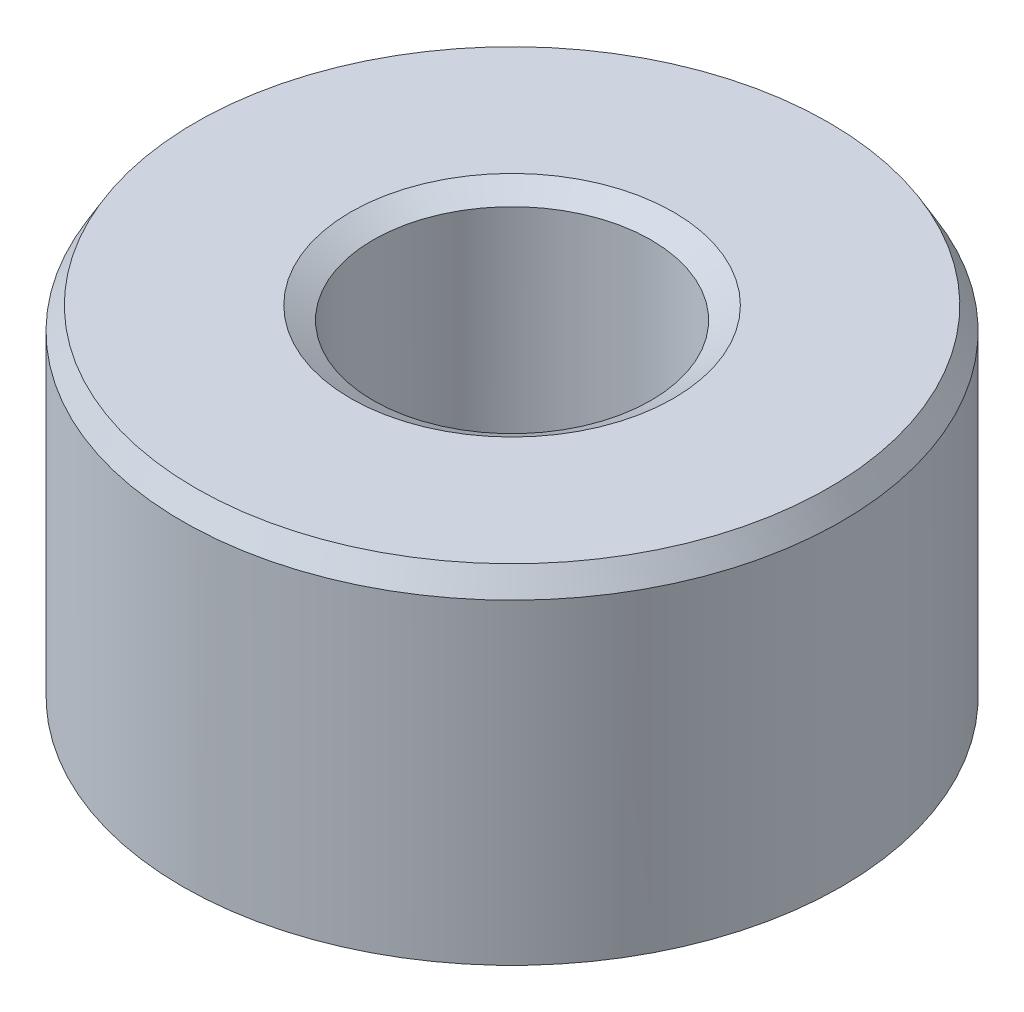
ISO-10303-21;
HEADER;
FILE_DESCRIPTION(('STEP AP214'),'2;1');
FILE_NAME('part.step','',(''),(''),'','','');
FILE_SCHEMA(('AUTOMOTIVE_DESIGN { 1 0 10303 214 1 1 1 1 }'));
ENDSEC;
DATA;
#1=APPLICATION_CONTEXT('core data for automotive mechanical design processes');
#2=APPLICATION_PROTOCOL_DEFINITION('international standard','automotive_design',2000,#1);
#3=PRODUCT_CONTEXT('',#1,'mechanical');
#4=PRODUCT('Part','Part','',(#3));
#5=PRODUCT_RELATED_PRODUCT_CATEGORY('part','',(#4));
#6=PRODUCT_DEFINITION_FORMATION('','',#4);
#7=PRODUCT_DEFINITION_CONTEXT('part definition',#1,'design');
#8=PRODUCT_DEFINITION('design','',#6,#7);
#9=PRODUCT_DEFINITION_SHAPE('','',#8);
#10=(LENGTH_UNIT() NAMED_UNIT(*) SI_UNIT(.MILLI.,.METRE.));
#11=(NAMED_UNIT(*) PLANE_ANGLE_UNIT() SI_UNIT($,.RADIAN.));
#12=(NAMED_UNIT(*) SI_UNIT($,.STERADIAN.) SOLID_ANGLE_UNIT());
#13=UNCERTAINTY_MEASURE_WITH_UNIT(LENGTH_MEASURE(1.E-05),#10,'distance_accuracy_value','');
#14=(GEOMETRIC_REPRESENTATION_CONTEXT(3) GLOBAL_UNCERTAINTY_ASSIGNED_CONTEXT((#13)) GLOBAL_UNIT_ASSIGNED_CONTEXT((#10,
#11,#12)) REPRESENTATION_CONTEXT('',''));
#15=CARTESIAN_POINT('',(0.,0.,0.));
#16=DIRECTION('',(0.,0.,1.));
#17=DIRECTION('',(1.,0.,0.));
#18=AXIS2_PLACEMENT_3D('',#15,#16,#17);
#19=CARTESIAN_POINT('',(0.,61.3514045322758,0.));
#20=DIRECTION('',(0.,-1.,0.));
#21=DIRECTION('',(0.,0.,-1.));
#22=AXIS2_PLACEMENT_3D('',#19,#20,#21);
#23=CYLINDRICAL_SURFACE('',#22,57.5);
#24=CARTESIAN_POINT('',(0.,2.25971727212847,0.));
#25=DIRECTION('',(0.,1.,0.));
#26=DIRECTION('',(0.,0.,1.));
#27=AXIS2_PLACEMENT_3D('',#24,#25,#26);
#28=CIRCLE('',#27,57.5);
#29=CARTESIAN_POINT('',(0.,2.25971727212847,-57.5));
#30=VERTEX_POINT('',#29);
#31=EDGE_CURVE('E10',#30,#30,#28,.T.);
#32=CARTESIAN_POINT('',(0.,57.4374594062086,0.));
#33=DIRECTION('',(0.,1.,0.));
#34=DIRECTION('',(0.,0.,1.));
#35=AXIS2_PLACEMENT_3D('',#32,#33,#34);
#36=CIRCLE('',#35,57.5);
#37=CARTESIAN_POINT('',(0.,57.4374594062086,-57.5));
#38=VERTEX_POINT('',#37);
#39=EDGE_CURVE('E50',#38,#38,#36,.F.);
#40=CARTESIAN_POINT('',(0.,2.25971727212847,-57.5));
#41=CARTESIAN_POINT('',(0.,2.83448541935847,-57.5));
#42=CARTESIAN_POINT('',(0.,3.40925356658847,-57.5));
#43=CARTESIAN_POINT('',(0.,4.55878986104847,-57.5));
#44=CARTESIAN_POINT('',(0.,5.13355800827847,-57.5));
#45=CARTESIAN_POINT('',(0.,6.28309430273848,-57.5));
#46=CARTESIAN_POINT('',(0.,6.85786244996848,-57.5));
#47=CARTESIAN_POINT('',(0.,8.00739874442848,-57.5));
#48=CARTESIAN_POINT('',(0.,8.58216689165848,-57.5));
#49=CARTESIAN_POINT('',(0.,9.73170318611849,-57.5));
#50=CARTESIAN_POINT('',(0.,10.3064713333485,-57.5));
#51=CARTESIAN_POINT('',(0.,11.4560076278085,-57.5));
#52=CARTESIAN_POINT('',(0.,12.0307757750385,-57.5));
#53=CARTESIAN_POINT('',(0.,13.1803120694985,-57.5));
#54=CARTESIAN_POINT('',(0.,13.7550802167285,-57.5));
#55=CARTESIAN_POINT('',(0.,14.9046165111885,-57.5));
#56=CARTESIAN_POINT('',(0.,15.4793846584185,-57.5));
#57=CARTESIAN_POINT('',(0.,16.6289209528785,-57.5));
#58=CARTESIAN_POINT('',(0.,17.2036891001085,-57.5));
#59=CARTESIAN_POINT('',(0.,18.3532253945685,-57.5));
#60=CARTESIAN_POINT('',(0.,18.9279935417985,-57.5));
#61=CARTESIAN_POINT('',(0.,20.0775298362585,-57.5));
#62=CARTESIAN_POINT('',(0.,20.6522979834885,-57.5));
#63=CARTESIAN_POINT('',(0.,21.8018342779485,-57.5));
#64=CARTESIAN_POINT('',(0.,22.3766024251785,-57.5));
#65=CARTESIAN_POINT('',(0.,23.5261387196385,-57.5));
#66=CARTESIAN_POINT('',(0.,24.1009068668685,-57.5));
#67=CARTESIAN_POINT('',(0.,25.2504431613285,-57.5));
#68=CARTESIAN_POINT('',(0.,25.8252113085585,-57.5));
#69=CARTESIAN_POINT('',(0.,26.9747476030185,-57.5));
#70=CARTESIAN_POINT('',(0.,27.5495157502485,-57.5));
#71=CARTESIAN_POINT('',(0.,28.6990520447085,-57.5));
#72=CARTESIAN_POINT('',(0.,29.2738201919385,-57.5));
#73=CARTESIAN_POINT('',(0.,30.4233564863985,-57.5));
#74=CARTESIAN_POINT('',(0.,30.9981246336285,-57.5));
#75=CARTESIAN_POINT('',(0.,32.1476609280885,-57.5));
#76=CARTESIAN_POINT('',(0.,32.7224290753185,-57.5));
#77=CARTESIAN_POINT('',(0.,33.8719653697786,-57.5));
#78=CARTESIAN_POINT('',(0.,34.4467335170085,-57.5));
#79=CARTESIAN_POINT('',(0.,35.5962698114686,-57.5));
#80=CARTESIAN_POINT('',(0.,36.1710379586986,-57.5));
#81=CARTESIAN_POINT('',(0.,37.3205742531586,-57.5));
#82=CARTESIAN_POINT('',(0.,37.8953424003886,-57.5));
#83=CARTESIAN_POINT('',(0.,39.0448786948486,-57.5));
#84=CARTESIAN_POINT('',(0.,39.6196468420786,-57.5));
#85=CARTESIAN_POINT('',(0.,40.7691831365386,-57.5));
#86=CARTESIAN_POINT('',(0.,41.3439512837686,-57.5));
#87=CARTESIAN_POINT('',(0.,42.4934875782286,-57.5));
#88=CARTESIAN_POINT('',(0.,43.0682557254586,-57.5));
#89=CARTESIAN_POINT('',(0.,44.2177920199186,-57.5));
#90=CARTESIAN_POINT('',(0.,44.7925601671486,-57.5));
#91=CARTESIAN_POINT('',(0.,45.9420964616086,-57.5));
#92=CARTESIAN_POINT('',(0.,46.5168646088386,-57.5));
#93=CARTESIAN_POINT('',(0.,47.6664009032986,-57.5));
#94=CARTESIAN_POINT('',(0.,48.2411690505286,-57.5));
#95=CARTESIAN_POINT('',(0.,49.3907053449886,-57.5));
#96=CARTESIAN_POINT('',(0.,49.9654734922186,-57.5));
#97=CARTESIAN_POINT('',(0.,51.1150097866786,-57.5));
#98=CARTESIAN_POINT('',(0.,51.6897779339086,-57.5));
#99=CARTESIAN_POINT('',(0.,52.8393142283686,-57.5));
#100=CARTESIAN_POINT('',(0.,53.4140823755986,-57.5));
#101=CARTESIAN_POINT('',(0.,54.5636186700586,-57.5));
#102=CARTESIAN_POINT('',(0.,55.1383868172886,-57.5));
#103=CARTESIAN_POINT('',(0.,56.2879231117486,-57.5));
#104=CARTESIAN_POINT('',(0.,56.8626912589786,-57.5));
#105=CARTESIAN_POINT('',(0.,57.4374594062086,-57.5));
#106=B_SPLINE_CURVE_WITH_KNOTS('',3,(#40,#41,#42,#43,#44,#45,#46,#47,#48,#49,#50,#51,#52,#53,
#54,#55,#56,#57,#58,#59,#60,#61,#62,#63,#64,#65,#66,#67,#68,#69,#70,#71,#72,#73,#74,#75,#76,#77,
#78,#79,#80,#81,#82,#83,#84,#85,#86,#87,#88,#89,#90,#91,#92,#93,#94,#95,#96,#97,#98,#99,#100,
#101,#102,#103,#104,#105),.UNSPECIFIED.,.F.,.F.,(4,2,2,2,2,2,2,2,2,2,2,2,2,2,2,2,2,2,2,2,2,2,2,
2,2,2,2,2,2,2,2,2,4),(0.,1.72430444169001,3.44860888338001,5.17291332507001,6.89721776676002,
8.62152220845003,10.34582665014,12.07013109183,13.79443553352,15.51873997521,17.2430444169,
18.9673488585901,20.6916533002801,22.4159577419701,24.1402621836601,25.8645666253501,
27.5888710670401,29.3131755087301,31.0374799504201,32.7617843921101,34.4860888338001,
36.2103932754901,37.9346977171801,39.6590021588701,41.3833066005601,43.1076110422501,
44.8319154839401,46.5562199256301,48.2805243673201,50.0048288090101,51.7291332507001,
53.4534376923901,55.1777421340801),.UNSPECIFIED.);
#107=EDGE_CURVE('BSEAM39',#30,#38,#106,.T.);
#108=ORIENTED_EDGE('',*,*,#31,.T.);
#109=ORIENTED_EDGE('',*,*,#39,.T.);
#110=ORIENTED_EDGE('',*,*,#107,.T.);
#111=ORIENTED_EDGE('',*,*,#107,.F.);
#112=EDGE_LOOP('',(#108,#110,#109,#111));
#113=FACE_BOUND('',#112,.T.);
#114=ADVANCED_FACE('F39',(#113),#23,.T.);
#115=CARTESIAN_POINT('',(0.,61.3514045322758,0.));
#116=DIRECTION('',(0.,1.,0.));
#117=DIRECTION('',(0.,0.,1.));
#118=AXIS2_PLACEMENT_3D('',#115,#116,#117);
#119=PLANE('',#118);
#120=CARTESIAN_POINT('',(0.,61.3514045322758,0.));
#121=DIRECTION('',(0.,1.,0.));
#122=DIRECTION('',(0.,0.,1.));
#123=AXIS2_PLACEMENT_3D('',#120,#121,#122);
#124=CIRCLE('',#123,28.1680575371118);
#125=CARTESIAN_POINT('',(0.,61.3514045322758,28.1680575371118));
#126=VERTEX_POINT('',#125);
#127=EDGE_CURVE('E58',#126,#126,#124,.F.);
#128=ORIENTED_EDGE('',*,*,#127,.T.);
#129=EDGE_LOOP('',(#128));
#130=FACE_BOUND('',#129,.T.);
#131=CARTESIAN_POINT('',(0.,61.3514045322758,0.));
#132=DIRECTION('',(0.,1.,0.));
#133=DIRECTION('',(0.,0.,1.));
#134=AXIS2_PLACEMENT_3D('',#131,#132,#133);
#135=CIRCLE('',#134,55.2402827278717);
#136=CARTESIAN_POINT('',(0.,61.3514045322758,55.2402827278717));
#137=VERTEX_POINT('',#136);
#138=EDGE_CURVE('E61',#137,#137,#135,.T.);
#139=ORIENTED_EDGE('',*,*,#138,.T.);
#140=EDGE_LOOP('',(#139));
#141=FACE_BOUND('',#140,.T.);
#142=ADVANCED_FACE('F88',(#130,#141),#119,.T.);
#143=CARTESIAN_POINT('',(0.,0.,0.));
#144=DIRECTION('',(0.,1.,0.));
#145=DIRECTION('',(0.,0.,1.));
#146=AXIS2_PLACEMENT_3D('',#143,#144,#145);
#147=PLANE('',#146);
#148=CARTESIAN_POINT('',(0.,0.,0.));
#149=DIRECTION('',(0.,1.,0.));
#150=DIRECTION('',(0.,0.,1.));
#151=AXIS2_PLACEMENT_3D('',#148,#149,#150);
#152=CIRCLE('',#151,26.5138296831727);
#153=CARTESIAN_POINT('',(0.,0.,26.5138296831727));
#154=VERTEX_POINT('',#153);
#155=EDGE_CURVE('E51',#154,#154,#152,.T.);
#156=ORIENTED_EDGE('',*,*,#155,.T.);
#157=EDGE_LOOP('',(#156));
#158=FACE_BOUND('',#157,.T.);
#159=CARTESIAN_POINT('',(0.,0.,0.));
#160=DIRECTION('',(0.,1.,0.));
#161=DIRECTION('',(0.,0.,1.));
#162=AXIS2_PLACEMENT_3D('',#159,#160,#161);
#163=CIRCLE('',#162,53.5860548739325);
#164=CARTESIAN_POINT('',(0.,0.,53.5860548739325));
#165=VERTEX_POINT('',#164);
#166=EDGE_CURVE('E54',#165,#165,#163,.F.);
#167=ORIENTED_EDGE('',*,*,#166,.T.);
#168=EDGE_LOOP('',(#167));
#169=FACE_BOUND('',#168,.T.);
#170=ADVANCED_FACE('F83',(#158,#169),#147,.F.);
#171=CARTESIAN_POINT('',(0.,61.3514045322758,0.));
#172=DIRECTION('',(0.,-1.,0.));
#173=DIRECTION('',(0.,0.,-1.));
#174=AXIS2_PLACEMENT_3D('',#171,#172,#173);
#175=CYLINDRICAL_SURFACE('',#174,24.2541124110443);
#176=CARTESIAN_POINT('',(0.,59.0916872601473,0.));
#177=DIRECTION('',(0.,1.,0.));
#178=DIRECTION('',(0.,0.,1.));
#179=AXIS2_PLACEMENT_3D('',#176,#177,#178);
#180=CIRCLE('',#179,24.2541124110443);
#181=CARTESIAN_POINT('',(0.,59.0916872601473,-24.2541124110443));
#182=VERTEX_POINT('',#181);
#183=EDGE_CURVE('E67',#182,#182,#180,.T.);
#184=CARTESIAN_POINT('',(0.,3.91394512606734,0.));
#185=DIRECTION('',(0.,1.,0.));
#186=DIRECTION('',(0.,0.,1.));
#187=AXIS2_PLACEMENT_3D('',#184,#185,#186);
#188=CIRCLE('',#187,24.2541124110443);
#189=CARTESIAN_POINT('',(0.,3.91394512606734,-24.2541124110443));
#190=VERTEX_POINT('',#189);
#191=EDGE_CURVE('E69',#190,#190,#188,.F.);
#192=CARTESIAN_POINT('',(0.,59.0916872601473,-24.2541124110443));
#193=CARTESIAN_POINT('',(0.,58.5169191129173,-24.2541124110443));
#194=CARTESIAN_POINT('',(0.,57.9421509656873,-24.2541124110443));
#195=CARTESIAN_POINT('',(0.,56.7926146712273,-24.2541124110443));
#196=CARTESIAN_POINT('',(0.,56.2178465239973,-24.2541124110443));
#197=CARTESIAN_POINT('',(0.,55.0683102295373,-24.2541124110443));
#198=CARTESIAN_POINT('',(0.,54.4935420823073,-24.2541124110443));
#199=CARTESIAN_POINT('',(0.,53.3440057878473,-24.2541124110443));
#200=CARTESIAN_POINT('',(0.,52.7692376406173,-24.2541124110443));
#201=CARTESIAN_POINT('',(0.,51.6197013461573,-24.2541124110443));
#202=CARTESIAN_POINT('',(0.,51.0449331989273,-24.2541124110443));
#203=CARTESIAN_POINT('',(0.,49.8953969044673,-24.2541124110443));
#204=CARTESIAN_POINT('',(0.,49.3206287572373,-24.2541124110443));
#205=CARTESIAN_POINT('',(0.,48.1710924627773,-24.2541124110443));
#206=CARTESIAN_POINT('',(0.,47.5963243155473,-24.2541124110443));
#207=CARTESIAN_POINT('',(0.,46.4467880210873,-24.2541124110443));
#208=CARTESIAN_POINT('',(0.,45.8720198738573,-24.2541124110443));
#209=CARTESIAN_POINT('',(0.,44.7224835793973,-24.2541124110443));
#210=CARTESIAN_POINT('',(0.,44.1477154321673,-24.2541124110443));
#211=CARTESIAN_POINT('',(0.,42.9981791377073,-24.2541124110443));
#212=CARTESIAN_POINT('',(0.,42.4234109904773,-24.2541124110443));
#213=CARTESIAN_POINT('',(0.,41.2738746960173,-24.2541124110443));
#214=CARTESIAN_POINT('',(0.,40.6991065487873,-24.2541124110443));
#215=CARTESIAN_POINT('',(0.,39.5495702543273,-24.2541124110443));
#216=CARTESIAN_POINT('',(0.,38.9748021070973,-24.2541124110443));
#217=CARTESIAN_POINT('',(0.,37.8252658126373,-24.2541124110443));
#218=CARTESIAN_POINT('',(0.,37.2504976654073,-24.2541124110443));
#219=CARTESIAN_POINT('',(0.,36.1009613709473,-24.2541124110443));
#220=CARTESIAN_POINT('',(0.,35.5261932237173,-24.2541124110443));
#221=CARTESIAN_POINT('',(0.,34.3766569292573,-24.2541124110443));
#222=CARTESIAN_POINT('',(0.,33.8018887820273,-24.2541124110443));
#223=CARTESIAN_POINT('',(0.,32.6523524875673,-24.2541124110443));
#224=CARTESIAN_POINT('',(0.,32.0775843403373,-24.2541124110443));
#225=CARTESIAN_POINT('',(0.,30.9280480458773,-24.2541124110443));
#226=CARTESIAN_POINT('',(0.,30.3532798986473,-24.2541124110443));
#227=CARTESIAN_POINT('',(0.,29.2037436041873,-24.2541124110443));
#228=CARTESIAN_POINT('',(0.,28.6289754569573,-24.2541124110443));
#229=CARTESIAN_POINT('',(0.,27.4794391624973,-24.2541124110443));
#230=CARTESIAN_POINT('',(0.,26.9046710152673,-24.2541124110443));
#231=CARTESIAN_POINT('',(0.,25.7551347208073,-24.2541124110443));
#232=CARTESIAN_POINT('',(0.,25.1803665735773,-24.2541124110443));
#233=CARTESIAN_POINT('',(0.,24.0308302791173,-24.2541124110443));
#234=CARTESIAN_POINT('',(0.,23.4560621318873,-24.2541124110443));
#235=CARTESIAN_POINT('',(0.,22.3065258374273,-24.2541124110443));
#236=CARTESIAN_POINT('',(0.,21.7317576901973,-24.2541124110443));
#237=CARTESIAN_POINT('',(0.,20.5822213957373,-24.2541124110443));
#238=CARTESIAN_POINT('',(0.,20.0074532485073,-24.2541124110443));
#239=CARTESIAN_POINT('',(0.,18.8579169540473,-24.2541124110443));
#240=CARTESIAN_POINT('',(0.,18.2831488068173,-24.2541124110443));
#241=CARTESIAN_POINT('',(0.,17.1336125123573,-24.2541124110443));
#242=CARTESIAN_POINT('',(0.,16.5588443651273,-24.2541124110443));
#243=CARTESIAN_POINT('',(0.,15.4093080706673,-24.2541124110443));
#244=CARTESIAN_POINT('',(0.,14.8345399234373,-24.2541124110443));
#245=CARTESIAN_POINT('',(0.,13.6850036289773,-24.2541124110443));
#246=CARTESIAN_POINT('',(0.,13.1102354817473,-24.2541124110443));
#247=CARTESIAN_POINT('',(0.,11.9606991872873,-24.2541124110443));
#248=CARTESIAN_POINT('',(0.,11.3859310400573,-24.2541124110443));
#249=CARTESIAN_POINT('',(0.,10.2363947455973,-24.2541124110443));
#250=CARTESIAN_POINT('',(0.,9.66162659836734,-24.2541124110443));
#251=CARTESIAN_POINT('',(0.,8.51209030390734,-24.2541124110443));
#252=CARTESIAN_POINT('',(0.,7.93732215667734,-24.2541124110443));
#253=CARTESIAN_POINT('',(0.,6.78778586221734,-24.2541124110443));
#254=CARTESIAN_POINT('',(0.,6.21301771498734,-24.2541124110443));
#255=CARTESIAN_POINT('',(0.,5.06348142052734,-24.2541124110443));
#256=CARTESIAN_POINT('',(0.,4.48871327329734,-24.2541124110443));
#257=CARTESIAN_POINT('',(0.,3.91394512606734,-24.2541124110443));
#258=B_SPLINE_CURVE_WITH_KNOTS('',3,(#192,#193,#194,#195,#196,#197,#198,#199,#200,#201,#202,
#203,#204,#205,#206,#207,#208,#209,#210,#211,#212,#213,#214,#215,#216,#217,#218,#219,#220,#221,
#222,#223,#224,#225,#226,#227,#228,#229,#230,#231,#232,#233,#234,#235,#236,#237,#238,#239,#240,
#241,#242,#243,#244,#245,#246,#247,#248,#249,#250,#251,#252,#253,#254,#255,#256,#257),
.UNSPECIFIED.,.F.,.F.,(4,2,2,2,2,2,2,2,2,2,2,2,2,2,2,2,2,2,2,2,2,2,2,2,2,2,2,2,2,2,2,2,4),(0.,
1.72430444169,3.44860888338001,5.17291332507001,6.89721776676001,8.62152220845001,
10.34582665014,12.07013109183,13.79443553352,15.51873997521,17.2430444169,18.96734885859,
20.69165330028,22.41595774197,24.14026218366,25.86456662535,27.58887106704,29.31317550873,
31.03747995042,32.76178439211,34.4860888338,36.21039327549,37.93469771718,39.65900215887,
41.38330660056,43.10761104225,44.83191548394,46.55621992563,48.28052436732,50.00482880901,
51.7291332507,53.45343769239,55.17774213408),.UNSPECIFIED.);
#259=EDGE_CURVE('BSEAM71',#182,#190,#258,.T.);
#260=ORIENTED_EDGE('',*,*,#183,.T.);
#261=ORIENTED_EDGE('',*,*,#191,.T.);
#262=ORIENTED_EDGE('',*,*,#259,.T.);
#263=ORIENTED_EDGE('',*,*,#259,.F.);
#264=EDGE_LOOP('',(#260,#262,#261,#263));
#265=FACE_BOUND('',#264,.T.);
#266=ADVANCED_FACE('F71',(#265),#175,.F.);
#267=CARTESIAN_POINT('',(0.,59.0916872601473,0.));
#268=DIRECTION('',(0.,1.,0.));
#269=DIRECTION('',(0.,0.,1.));
#270=AXIS2_PLACEMENT_3D('',#267,#268,#269);
#271=CONICAL_SURFACE('',#270,24.2541124110443,1.0471975511966);
#272=ORIENTED_EDGE('',*,*,#127,.F.);
#273=EDGE_LOOP('',(#272));
#274=FACE_BOUND('',#273,.T.);
#275=ORIENTED_EDGE('',*,*,#183,.F.);
#276=EDGE_LOOP('',(#275));
#277=FACE_BOUND('',#276,.T.);
#278=ADVANCED_FACE('F77',(#274,#277),#271,.F.);
#279=CARTESIAN_POINT('',(0.,0.,0.));
#280=DIRECTION('',(0.,-1.,0.));
#281=DIRECTION('',(0.,0.,-1.));
#282=AXIS2_PLACEMENT_3D('',#279,#280,#281);
#283=CONICAL_SURFACE('',#282,26.5138296831727,0.523598775598294);
#284=ORIENTED_EDGE('',*,*,#191,.F.);
#285=EDGE_LOOP('',(#284));
#286=FACE_BOUND('',#285,.T.);
#287=ORIENTED_EDGE('',*,*,#155,.F.);
#288=EDGE_LOOP('',(#287));
#289=FACE_BOUND('',#288,.T.);
#290=ADVANCED_FACE('F73',(#286,#289),#283,.F.);
#291=CARTESIAN_POINT('',(0.,2.25971727212847,0.));
#292=DIRECTION('',(0.,1.,0.));
#293=DIRECTION('',(0.,0.,1.));
#294=AXIS2_PLACEMENT_3D('',#291,#292,#293);
#295=CONICAL_SURFACE('',#294,57.5,1.0471975511966);
#296=ORIENTED_EDGE('',*,*,#166,.F.);
#297=EDGE_LOOP('',(#296));
#298=FACE_BOUND('',#297,.T.);
#299=ORIENTED_EDGE('',*,*,#31,.F.);
#300=EDGE_LOOP('',(#299));
#301=FACE_BOUND('',#300,.T.);
#302=ADVANCED_FACE('F76',(#298,#301),#295,.T.);
#303=CARTESIAN_POINT('',(0.,61.3514045322758,0.));
#304=DIRECTION('',(0.,-1.,0.));
#305=DIRECTION('',(0.,0.,-1.));
#306=AXIS2_PLACEMENT_3D('',#303,#304,#305);
#307=CONICAL_SURFACE('',#306,55.2402827278717,0.523598775598295);
#308=ORIENTED_EDGE('',*,*,#39,.F.);
#309=EDGE_LOOP('',(#308));
#310=FACE_BOUND('',#309,.T.);
#311=ORIENTED_EDGE('',*,*,#138,.F.);
#312=EDGE_LOOP('',(#311));
#313=FACE_BOUND('',#312,.T.);
#314=ADVANCED_FACE('F45',(#310,#313),#307,.T.);
#315=CLOSED_SHELL('',(#114,#142,#170,#266,#278,#290,#302,#314));
#316=MANIFOLD_SOLID_BREP('B2',#315);
#317=ADVANCED_BREP_SHAPE_REPRESENTATION('',(#18,#316),#14);
#318=SHAPE_DEFINITION_REPRESENTATION(#9,#317);
ENDSEC;
END-ISO-10303-21;
